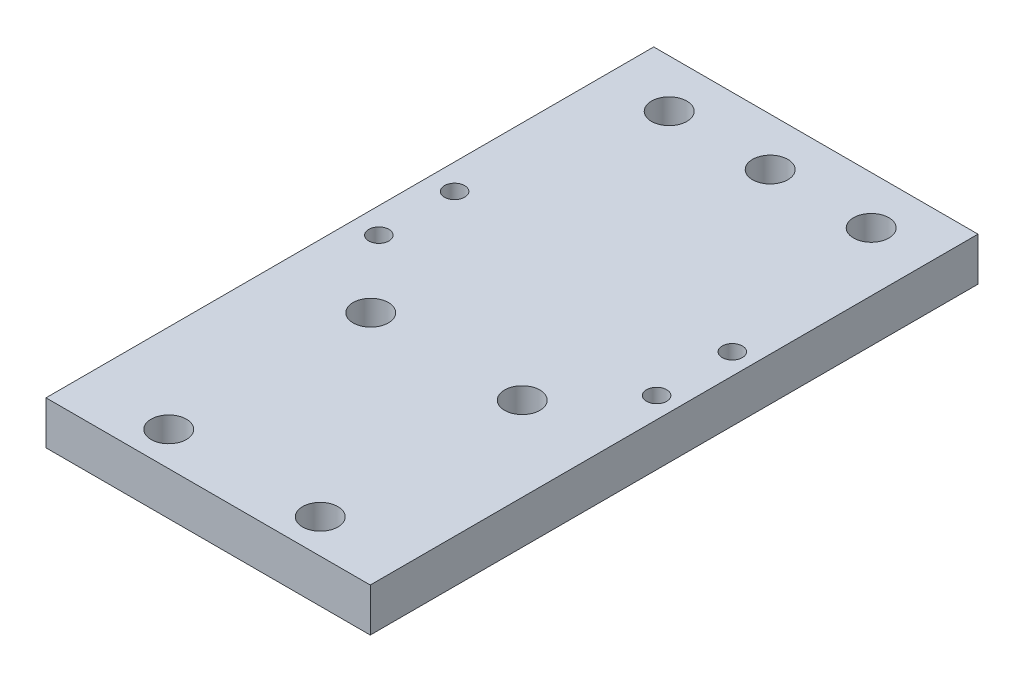
ISO-10303-21;
HEADER;
FILE_DESCRIPTION(('STEP AP214'),'2;1');
FILE_NAME('part.step','',(''),(''),'','','');
FILE_SCHEMA(('AUTOMOTIVE_DESIGN { 1 0 10303 214 1 1 1 1 }'));
ENDSEC;
DATA;
#1=APPLICATION_CONTEXT('core data for automotive mechanical design processes');
#2=APPLICATION_PROTOCOL_DEFINITION('international standard','automotive_design',2000,#1);
#3=PRODUCT_CONTEXT('',#1,'mechanical');
#4=PRODUCT('Part','Part','',(#3));
#5=PRODUCT_RELATED_PRODUCT_CATEGORY('part','',(#4));
#6=PRODUCT_DEFINITION_FORMATION('','',#4);
#7=PRODUCT_DEFINITION_CONTEXT('part definition',#1,'design');
#8=PRODUCT_DEFINITION('design','',#6,#7);
#9=PRODUCT_DEFINITION_SHAPE('','',#8);
#10=(LENGTH_UNIT() NAMED_UNIT(*) SI_UNIT(.MILLI.,.METRE.));
#11=(NAMED_UNIT(*) PLANE_ANGLE_UNIT() SI_UNIT($,.RADIAN.));
#12=(NAMED_UNIT(*) SI_UNIT($,.STERADIAN.) SOLID_ANGLE_UNIT());
#13=UNCERTAINTY_MEASURE_WITH_UNIT(LENGTH_MEASURE(1.E-05),#10,'distance_accuracy_value','');
#14=(GEOMETRIC_REPRESENTATION_CONTEXT(3) GLOBAL_UNCERTAINTY_ASSIGNED_CONTEXT((#13)) GLOBAL_UNIT_ASSIGNED_CONTEXT((#10,
#11,#12)) REPRESENTATION_CONTEXT('',''));
#15=CARTESIAN_POINT('',(0.,0.,0.));
#16=DIRECTION('',(0.,0.,1.));
#17=DIRECTION('',(1.,0.,0.));
#18=AXIS2_PLACEMENT_3D('',#15,#16,#17);
#19=CARTESIAN_POINT('',(16.0528,4.2926,-60.1726));
#20=DIRECTION('',(-1.,0.,0.));
#21=DIRECTION('',(0.,0.,1.));
#22=AXIS2_PLACEMENT_3D('',#19,#20,#21);
#23=PLANE('',#22);
#24=DIRECTION('',(0.,0.,-1.));
#25=VECTOR('',#24,1.);
#26=CARTESIAN_POINT('',(16.0528,0.,-60.1726));
#27=LINE('',#26,#25);
#28=CARTESIAN_POINT('',(16.0528,0.,0.));
#29=VERTEX_POINT('',#28);
#30=CARTESIAN_POINT('',(16.0528,0.,-60.1726));
#31=VERTEX_POINT('',#30);
#32=EDGE_CURVE('E107',#29,#31,#27,.T.);
#33=ORIENTED_EDGE('',*,*,#32,.T.);
#34=DIRECTION('',(0.,-1.,0.));
#35=VECTOR('',#34,1.);
#36=CARTESIAN_POINT('',(16.0528,4.2926,-60.1726));
#37=LINE('',#36,#35);
#38=CARTESIAN_POINT('',(16.0528,4.2926,-60.1726));
#39=VERTEX_POINT('',#38);
#40=EDGE_CURVE('E11',#39,#31,#37,.T.);
#41=ORIENTED_EDGE('',*,*,#40,.F.);
#42=DIRECTION('',(0.,0.,-1.));
#43=VECTOR('',#42,1.);
#44=CARTESIAN_POINT('',(16.0528,4.2926,-60.1726));
#45=LINE('',#44,#43);
#46=CARTESIAN_POINT('',(16.0528,4.2926,0.));
#47=VERTEX_POINT('',#46);
#48=EDGE_CURVE('E91',#47,#39,#45,.T.);
#49=ORIENTED_EDGE('',*,*,#48,.F.);
#50=DIRECTION('',(0.,-1.,0.));
#51=VECTOR('',#50,1.);
#52=CARTESIAN_POINT('',(16.0528,4.2926,0.));
#53=LINE('',#52,#51);
#54=EDGE_CURVE('E103',#47,#29,#53,.T.);
#55=ORIENTED_EDGE('',*,*,#54,.T.);
#56=EDGE_LOOP('',(#33,#41,#49,#55));
#57=FACE_BOUND('',#56,.T.);
#58=ADVANCED_FACE('F39',(#57),#23,.F.);
#59=CARTESIAN_POINT('',(-16.0528,4.2926,-60.1726));
#60=DIRECTION('',(0.,0.,1.));
#61=DIRECTION('',(1.,0.,0.));
#62=AXIS2_PLACEMENT_3D('',#59,#60,#61);
#63=PLANE('',#62);
#64=DIRECTION('',(-1.,0.,0.));
#65=VECTOR('',#64,1.);
#66=CARTESIAN_POINT('',(-16.0528,0.,-60.1726));
#67=LINE('',#66,#65);
#68=CARTESIAN_POINT('',(-16.0528,0.,-60.1726));
#69=VERTEX_POINT('',#68);
#70=EDGE_CURVE('E96',#31,#69,#67,.T.);
#71=ORIENTED_EDGE('',*,*,#70,.T.);
#72=DIRECTION('',(0.,-1.,0.));
#73=VECTOR('',#72,1.);
#74=CARTESIAN_POINT('',(-16.0528,4.2926,-60.1726));
#75=LINE('',#74,#73);
#76=CARTESIAN_POINT('',(-16.0528,4.2926,-60.1726));
#77=VERTEX_POINT('',#76);
#78=EDGE_CURVE('E48',#77,#69,#75,.T.);
#79=ORIENTED_EDGE('',*,*,#78,.F.);
#80=DIRECTION('',(-1.,0.,0.));
#81=VECTOR('',#80,1.);
#82=CARTESIAN_POINT('',(-16.0528,4.2926,-60.1726));
#83=LINE('',#82,#81);
#84=EDGE_CURVE('E86',#39,#77,#83,.T.);
#85=ORIENTED_EDGE('',*,*,#84,.F.);
#86=ORIENTED_EDGE('',*,*,#40,.T.);
#87=EDGE_LOOP('',(#71,#79,#85,#86));
#88=FACE_BOUND('',#87,.T.);
#89=ADVANCED_FACE('F95',(#88),#63,.F.);
#90=CARTESIAN_POINT('',(-16.0528,4.2926,-60.1726));
#91=DIRECTION('',(1.,0.,0.));
#92=DIRECTION('',(0.,0.,-1.));
#93=AXIS2_PLACEMENT_3D('',#90,#91,#92);
#94=PLANE('',#93);
#95=DIRECTION('',(0.,0.,1.));
#96=VECTOR('',#95,1.);
#97=CARTESIAN_POINT('',(-16.0528,0.,-60.1726));
#98=LINE('',#97,#96);
#99=CARTESIAN_POINT('',(-16.0528,0.,0.));
#100=VERTEX_POINT('',#99);
#101=EDGE_CURVE('E73',#69,#100,#98,.T.);
#102=ORIENTED_EDGE('',*,*,#101,.T.);
#103=DIRECTION('',(0.,-1.,0.));
#104=VECTOR('',#103,1.);
#105=CARTESIAN_POINT('',(-16.0528,4.2926,0.));
#106=LINE('',#105,#104);
#107=CARTESIAN_POINT('',(-16.0528,4.2926,0.));
#108=VERTEX_POINT('',#107);
#109=EDGE_CURVE('E98',#108,#100,#106,.T.);
#110=ORIENTED_EDGE('',*,*,#109,.F.);
#111=DIRECTION('',(0.,0.,1.));
#112=VECTOR('',#111,1.);
#113=CARTESIAN_POINT('',(-16.0528,4.2926,-60.1726));
#114=LINE('',#113,#112);
#115=EDGE_CURVE('E89',#77,#108,#114,.T.);
#116=ORIENTED_EDGE('',*,*,#115,.F.);
#117=ORIENTED_EDGE('',*,*,#78,.T.);
#118=EDGE_LOOP('',(#102,#110,#116,#117));
#119=FACE_BOUND('',#118,.T.);
#120=ADVANCED_FACE('F99',(#119),#94,.F.);
#121=CARTESIAN_POINT('',(-16.0528,4.2926,0.));
#122=DIRECTION('',(0.,0.,-1.));
#123=DIRECTION('',(-1.,0.,0.));
#124=AXIS2_PLACEMENT_3D('',#121,#122,#123);
#125=PLANE('',#124);
#126=DIRECTION('',(1.,0.,0.));
#127=VECTOR('',#126,1.);
#128=CARTESIAN_POINT('',(-16.0528,0.,0.));
#129=LINE('',#128,#127);
#130=EDGE_CURVE('E79',#100,#29,#129,.T.);
#131=ORIENTED_EDGE('',*,*,#130,.T.);
#132=ORIENTED_EDGE('',*,*,#54,.F.);
#133=DIRECTION('',(1.,0.,0.));
#134=VECTOR('',#133,1.);
#135=CARTESIAN_POINT('',(-16.0528,4.2926,0.));
#136=LINE('',#135,#134);
#137=EDGE_CURVE('E56',#108,#47,#136,.T.);
#138=ORIENTED_EDGE('',*,*,#137,.F.);
#139=ORIENTED_EDGE('',*,*,#109,.T.);
#140=EDGE_LOOP('',(#131,#132,#138,#139));
#141=FACE_BOUND('',#140,.T.);
#142=ADVANCED_FACE('F121',(#141),#125,.F.);
#143=CARTESIAN_POINT('',(0.,4.2926,0.));
#144=DIRECTION('',(0.,1.,0.));
#145=DIRECTION('',(0.,0.,1.));
#146=AXIS2_PLACEMENT_3D('',#143,#144,#145);
#147=PLANE('',#146);
#148=CARTESIAN_POINT('',(-13.522224542553,4.2926,-30.4226));
#149=DIRECTION('',(0.,1.,0.));
#150=DIRECTION('',(0.,0.,1.));
#151=AXIS2_PLACEMENT_3D('',#148,#149,#150);
#152=CIRCLE('',#151,1.);
#153=CARTESIAN_POINT('',(-13.522224542553,4.2926,-29.4226));
#154=VERTEX_POINT('',#153);
#155=EDGE_CURVE('E136',#154,#154,#152,.T.);
#156=ORIENTED_EDGE('',*,*,#155,.F.);
#157=EDGE_LOOP('',(#156));
#158=FACE_BOUND('',#157,.T.);
#159=CARTESIAN_POINT('',(-13.522224542553,4.2926,-37.9226));
#160=DIRECTION('',(0.,1.,0.));
#161=DIRECTION('',(0.,0.,1.));
#162=AXIS2_PLACEMENT_3D('',#159,#160,#161);
#163=CIRCLE('',#162,1.);
#164=CARTESIAN_POINT('',(-13.522224542553,4.2926,-36.9226));
#165=VERTEX_POINT('',#164);
#166=EDGE_CURVE('E144',#165,#165,#163,.T.);
#167=ORIENTED_EDGE('',*,*,#166,.F.);
#168=EDGE_LOOP('',(#167));
#169=FACE_BOUND('',#168,.T.);
#170=CARTESIAN_POINT('',(0.22777545744697,4.2926,-55.4226));
#171=DIRECTION('',(0.,1.,0.));
#172=DIRECTION('',(0.,0.,1.));
#173=AXIS2_PLACEMENT_3D('',#170,#171,#172);
#174=CIRCLE('',#173,1.75);
#175=CARTESIAN_POINT('',(0.22777545744697,4.2926,-53.6726));
#176=VERTEX_POINT('',#175);
#177=EDGE_CURVE('E178',#176,#176,#174,.T.);
#178=ORIENTED_EDGE('',*,*,#177,.F.);
#179=EDGE_LOOP('',(#178));
#180=FACE_BOUND('',#179,.T.);
#181=CARTESIAN_POINT('',(10.227775457447,4.2926,-55.4226));
#182=DIRECTION('',(0.,1.,0.));
#183=DIRECTION('',(0.,0.,1.));
#184=AXIS2_PLACEMENT_3D('',#181,#182,#183);
#185=CIRCLE('',#184,1.75);
#186=CARTESIAN_POINT('',(10.227775457447,4.2926,-53.6726));
#187=VERTEX_POINT('',#186);
#188=EDGE_CURVE('E170',#187,#187,#185,.T.);
#189=ORIENTED_EDGE('',*,*,#188,.F.);
#190=EDGE_LOOP('',(#189));
#191=FACE_BOUND('',#190,.T.);
#192=CARTESIAN_POINT('',(-7.27222454255303,4.2926,-3.37260000000001));
#193=DIRECTION('',(0.,1.,0.));
#194=DIRECTION('',(0.,0.,1.));
#195=AXIS2_PLACEMENT_3D('',#192,#193,#194);
#196=CIRCLE('',#195,1.75);
#197=CARTESIAN_POINT('',(-7.27222454255303,4.2926,-1.62260000000001));
#198=VERTEX_POINT('',#197);
#199=EDGE_CURVE('E162',#198,#198,#196,.T.);
#200=ORIENTED_EDGE('',*,*,#199,.F.);
#201=EDGE_LOOP('',(#200));
#202=FACE_BOUND('',#201,.T.);
#203=CARTESIAN_POINT('',(-7.27222454255303,4.2926,-23.3726));
#204=DIRECTION('',(0.,1.,0.));
#205=DIRECTION('',(0.,0.,1.));
#206=AXIS2_PLACEMENT_3D('',#203,#204,#205);
#207=CIRCLE('',#206,1.75);
#208=CARTESIAN_POINT('',(-7.27222454255303,4.2926,-21.6226));
#209=VERTEX_POINT('',#208);
#210=EDGE_CURVE('E153',#209,#209,#207,.T.);
#211=ORIENTED_EDGE('',*,*,#210,.F.);
#212=EDGE_LOOP('',(#211));
#213=FACE_BOUND('',#212,.T.);
#214=CARTESIAN_POINT('',(7.72777545744697,4.2926,-23.3726));
#215=DIRECTION('',(0.,1.,0.));
#216=DIRECTION('',(0.,0.,1.));
#217=AXIS2_PLACEMENT_3D('',#214,#215,#216);
#218=CIRCLE('',#217,1.75);
#219=CARTESIAN_POINT('',(7.72777545744697,4.2926,-21.6226));
#220=VERTEX_POINT('',#219);
#221=EDGE_CURVE('E208',#220,#220,#218,.T.);
#222=ORIENTED_EDGE('',*,*,#221,.F.);
#223=EDGE_LOOP('',(#222));
#224=FACE_BOUND('',#223,.T.);
#225=CARTESIAN_POINT('',(7.72777545744697,4.2926,-3.37260000000001));
#226=DIRECTION('',(0.,1.,0.));
#227=DIRECTION('',(0.,0.,1.));
#228=AXIS2_PLACEMENT_3D('',#225,#226,#227);
#229=CIRCLE('',#228,1.75);
#230=CARTESIAN_POINT('',(7.72777545744697,4.2926,-1.62260000000001));
#231=VERTEX_POINT('',#230);
#232=EDGE_CURVE('E200',#231,#231,#229,.T.);
#233=ORIENTED_EDGE('',*,*,#232,.F.);
#234=EDGE_LOOP('',(#233));
#235=FACE_BOUND('',#234,.T.);
#236=CARTESIAN_POINT('',(13.977775457447,4.2926,-30.4226));
#237=DIRECTION('',(0.,1.,0.));
#238=DIRECTION('',(0.,0.,1.));
#239=AXIS2_PLACEMENT_3D('',#236,#237,#238);
#240=CIRCLE('',#239,1.);
#241=CARTESIAN_POINT('',(13.977775457447,4.2926,-29.4226));
#242=VERTEX_POINT('',#241);
#243=EDGE_CURVE('E192',#242,#242,#240,.T.);
#244=ORIENTED_EDGE('',*,*,#243,.F.);
#245=EDGE_LOOP('',(#244));
#246=FACE_BOUND('',#245,.T.);
#247=CARTESIAN_POINT('',(13.977775457447,4.2926,-37.9226));
#248=DIRECTION('',(0.,1.,0.));
#249=DIRECTION('',(0.,0.,1.));
#250=AXIS2_PLACEMENT_3D('',#247,#248,#249);
#251=CIRCLE('',#250,1.);
#252=CARTESIAN_POINT('',(13.977775457447,4.2926,-36.9226));
#253=VERTEX_POINT('',#252);
#254=EDGE_CURVE('E152',#253,#253,#251,.T.);
#255=ORIENTED_EDGE('',*,*,#254,.F.);
#256=EDGE_LOOP('',(#255));
#257=FACE_BOUND('',#256,.T.);
#258=CARTESIAN_POINT('',(-9.77222454255303,4.2926,-55.4226));
#259=DIRECTION('',(0.,1.,0.));
#260=DIRECTION('',(0.,0.,1.));
#261=AXIS2_PLACEMENT_3D('',#258,#259,#260);
#262=CIRCLE('',#261,1.75);
#263=CARTESIAN_POINT('',(-9.77222454255303,4.2926,-53.6726));
#264=VERTEX_POINT('',#263);
#265=EDGE_CURVE('E128',#264,#264,#262,.T.);
#266=ORIENTED_EDGE('',*,*,#265,.F.);
#267=EDGE_LOOP('',(#266));
#268=FACE_BOUND('',#267,.T.);
#269=ORIENTED_EDGE('',*,*,#48,.T.);
#270=ORIENTED_EDGE('',*,*,#84,.T.);
#271=ORIENTED_EDGE('',*,*,#115,.T.);
#272=ORIENTED_EDGE('',*,*,#137,.T.);
#273=EDGE_LOOP('',(#269,#270,#271,#272));
#274=FACE_BOUND('',#273,.T.);
#275=ADVANCED_FACE('F87',(#158,#169,#180,#191,#202,#213,#224,#235,#246,#257,#268,#274),#147,.T.);
#276=CARTESIAN_POINT('',(0.,0.,0.));
#277=DIRECTION('',(0.,1.,0.));
#278=DIRECTION('',(0.,0.,1.));
#279=AXIS2_PLACEMENT_3D('',#276,#277,#278);
#280=PLANE('',#279);
#281=CARTESIAN_POINT('',(-13.522224542553,0.,-30.4226));
#282=DIRECTION('',(0.,1.,0.));
#283=DIRECTION('',(0.,0.,1.));
#284=AXIS2_PLACEMENT_3D('',#281,#282,#283);
#285=CIRCLE('',#284,1.);
#286=CARTESIAN_POINT('',(-13.522224542553,0.,-29.4226));
#287=VERTEX_POINT('',#286);
#288=EDGE_CURVE('E140',#287,#287,#285,.T.);
#289=ORIENTED_EDGE('',*,*,#288,.T.);
#290=EDGE_LOOP('',(#289));
#291=FACE_BOUND('',#290,.T.);
#292=CARTESIAN_POINT('',(-13.522224542553,0.,-37.9226));
#293=DIRECTION('',(0.,1.,0.));
#294=DIRECTION('',(0.,0.,1.));
#295=AXIS2_PLACEMENT_3D('',#292,#293,#294);
#296=CIRCLE('',#295,1.);
#297=CARTESIAN_POINT('',(-13.522224542553,0.,-36.9226));
#298=VERTEX_POINT('',#297);
#299=EDGE_CURVE('E148',#298,#298,#296,.T.);
#300=ORIENTED_EDGE('',*,*,#299,.T.);
#301=EDGE_LOOP('',(#300));
#302=FACE_BOUND('',#301,.T.);
#303=CARTESIAN_POINT('',(0.22777545744697,0.,-55.4226));
#304=DIRECTION('',(0.,1.,0.));
#305=DIRECTION('',(0.,0.,1.));
#306=AXIS2_PLACEMENT_3D('',#303,#304,#305);
#307=CIRCLE('',#306,1.75);
#308=CARTESIAN_POINT('',(0.22777545744697,0.,-53.6726));
#309=VERTEX_POINT('',#308);
#310=EDGE_CURVE('E132',#309,#309,#307,.T.);
#311=ORIENTED_EDGE('',*,*,#310,.T.);
#312=EDGE_LOOP('',(#311));
#313=FACE_BOUND('',#312,.T.);
#314=CARTESIAN_POINT('',(10.227775457447,0.,-55.4226));
#315=DIRECTION('',(0.,1.,0.));
#316=DIRECTION('',(0.,0.,1.));
#317=AXIS2_PLACEMENT_3D('',#314,#315,#316);
#318=CIRCLE('',#317,1.75);
#319=CARTESIAN_POINT('',(10.227775457447,0.,-53.6726));
#320=VERTEX_POINT('',#319);
#321=EDGE_CURVE('E174',#320,#320,#318,.T.);
#322=ORIENTED_EDGE('',*,*,#321,.T.);
#323=EDGE_LOOP('',(#322));
#324=FACE_BOUND('',#323,.T.);
#325=CARTESIAN_POINT('',(-7.27222454255303,0.,-3.37260000000001));
#326=DIRECTION('',(0.,1.,0.));
#327=DIRECTION('',(0.,0.,1.));
#328=AXIS2_PLACEMENT_3D('',#325,#326,#327);
#329=CIRCLE('',#328,1.75);
#330=CARTESIAN_POINT('',(-7.27222454255303,0.,-1.62260000000001));
#331=VERTEX_POINT('',#330);
#332=EDGE_CURVE('E166',#331,#331,#329,.T.);
#333=ORIENTED_EDGE('',*,*,#332,.T.);
#334=EDGE_LOOP('',(#333));
#335=FACE_BOUND('',#334,.T.);
#336=CARTESIAN_POINT('',(-7.27222454255303,0.,-23.3726));
#337=DIRECTION('',(0.,1.,0.));
#338=DIRECTION('',(0.,0.,1.));
#339=AXIS2_PLACEMENT_3D('',#336,#337,#338);
#340=CIRCLE('',#339,1.75);
#341=CARTESIAN_POINT('',(-7.27222454255303,0.,-21.6226));
#342=VERTEX_POINT('',#341);
#343=EDGE_CURVE('E157',#342,#342,#340,.T.);
#344=ORIENTED_EDGE('',*,*,#343,.T.);
#345=EDGE_LOOP('',(#344));
#346=FACE_BOUND('',#345,.T.);
#347=CARTESIAN_POINT('',(7.72777545744697,0.,-23.3726));
#348=DIRECTION('',(0.,1.,0.));
#349=DIRECTION('',(0.,0.,1.));
#350=AXIS2_PLACEMENT_3D('',#347,#348,#349);
#351=CIRCLE('',#350,1.75);
#352=CARTESIAN_POINT('',(7.72777545744697,0.,-21.6226));
#353=VERTEX_POINT('',#352);
#354=EDGE_CURVE('E158',#353,#353,#351,.T.);
#355=ORIENTED_EDGE('',*,*,#354,.T.);
#356=EDGE_LOOP('',(#355));
#357=FACE_BOUND('',#356,.T.);
#358=CARTESIAN_POINT('',(7.72777545744697,0.,-3.37260000000001));
#359=DIRECTION('',(0.,1.,0.));
#360=DIRECTION('',(0.,0.,1.));
#361=AXIS2_PLACEMENT_3D('',#358,#359,#360);
#362=CIRCLE('',#361,1.75);
#363=CARTESIAN_POINT('',(7.72777545744697,0.,-1.62260000000001));
#364=VERTEX_POINT('',#363);
#365=EDGE_CURVE('E204',#364,#364,#362,.T.);
#366=ORIENTED_EDGE('',*,*,#365,.T.);
#367=EDGE_LOOP('',(#366));
#368=FACE_BOUND('',#367,.T.);
#369=CARTESIAN_POINT('',(13.977775457447,0.,-30.4226));
#370=DIRECTION('',(0.,1.,0.));
#371=DIRECTION('',(0.,0.,1.));
#372=AXIS2_PLACEMENT_3D('',#369,#370,#371);
#373=CIRCLE('',#372,1.);
#374=CARTESIAN_POINT('',(13.977775457447,0.,-29.4226));
#375=VERTEX_POINT('',#374);
#376=EDGE_CURVE('E196',#375,#375,#373,.T.);
#377=ORIENTED_EDGE('',*,*,#376,.T.);
#378=EDGE_LOOP('',(#377));
#379=FACE_BOUND('',#378,.T.);
#380=CARTESIAN_POINT('',(13.977775457447,0.,-37.9226));
#381=DIRECTION('',(0.,1.,0.));
#382=DIRECTION('',(0.,0.,1.));
#383=AXIS2_PLACEMENT_3D('',#380,#381,#382);
#384=CIRCLE('',#383,1.);
#385=CARTESIAN_POINT('',(13.977775457447,0.,-36.9226));
#386=VERTEX_POINT('',#385);
#387=EDGE_CURVE('E188',#386,#386,#384,.T.);
#388=ORIENTED_EDGE('',*,*,#387,.T.);
#389=EDGE_LOOP('',(#388));
#390=FACE_BOUND('',#389,.T.);
#391=CARTESIAN_POINT('',(-9.77222454255303,0.,-55.4226));
#392=DIRECTION('',(0.,1.,0.));
#393=DIRECTION('',(0.,0.,1.));
#394=AXIS2_PLACEMENT_3D('',#391,#392,#393);
#395=CIRCLE('',#394,1.75);
#396=CARTESIAN_POINT('',(-9.77222454255303,0.,-53.6726));
#397=VERTEX_POINT('',#396);
#398=EDGE_CURVE('E111',#397,#397,#395,.T.);
#399=ORIENTED_EDGE('',*,*,#398,.T.);
#400=EDGE_LOOP('',(#399));
#401=FACE_BOUND('',#400,.T.);
#402=ORIENTED_EDGE('',*,*,#32,.F.);
#403=ORIENTED_EDGE('',*,*,#130,.F.);
#404=ORIENTED_EDGE('',*,*,#101,.F.);
#405=ORIENTED_EDGE('',*,*,#70,.F.);
#406=EDGE_LOOP('',(#402,#403,#404,#405));
#407=FACE_BOUND('',#406,.T.);
#408=ADVANCED_FACE('F124',(#291,#302,#313,#324,#335,#346,#357,#368,#379,#390,#401,#407),#280,.F.);
#409=CARTESIAN_POINT('',(-9.77222454255303,0.,-55.4226));
#410=DIRECTION('',(0.,1.,0.));
#411=DIRECTION('',(0.,0.,1.));
#412=AXIS2_PLACEMENT_3D('',#409,#410,#411);
#413=CYLINDRICAL_SURFACE('',#412,1.75);
#414=ORIENTED_EDGE('',*,*,#398,.F.);
#415=EDGE_LOOP('',(#414));
#416=FACE_BOUND('',#415,.T.);
#417=ORIENTED_EDGE('',*,*,#265,.T.);
#418=EDGE_LOOP('',(#417));
#419=FACE_BOUND('',#418,.T.);
#420=ADVANCED_FACE('F238',(#416,#419),#413,.F.);
#421=CARTESIAN_POINT('',(13.977775457447,0.,-37.9226));
#422=DIRECTION('',(0.,1.,0.));
#423=DIRECTION('',(0.,0.,1.));
#424=AXIS2_PLACEMENT_3D('',#421,#422,#423);
#425=CYLINDRICAL_SURFACE('',#424,1.);
#426=ORIENTED_EDGE('',*,*,#387,.F.);
#427=EDGE_LOOP('',(#426));
#428=FACE_BOUND('',#427,.T.);
#429=ORIENTED_EDGE('',*,*,#254,.T.);
#430=EDGE_LOOP('',(#429));
#431=FACE_BOUND('',#430,.T.);
#432=ADVANCED_FACE('F240',(#428,#431),#425,.F.);
#433=CARTESIAN_POINT('',(13.977775457447,0.,-30.4226));
#434=DIRECTION('',(0.,1.,0.));
#435=DIRECTION('',(0.,0.,1.));
#436=AXIS2_PLACEMENT_3D('',#433,#434,#435);
#437=CYLINDRICAL_SURFACE('',#436,1.);
#438=ORIENTED_EDGE('',*,*,#376,.F.);
#439=EDGE_LOOP('',(#438));
#440=FACE_BOUND('',#439,.T.);
#441=ORIENTED_EDGE('',*,*,#243,.T.);
#442=EDGE_LOOP('',(#441));
#443=FACE_BOUND('',#442,.T.);
#444=ADVANCED_FACE('F247',(#440,#443),#437,.F.);
#445=CARTESIAN_POINT('',(7.72777545744697,0.,-3.37260000000001));
#446=DIRECTION('',(0.,1.,0.));
#447=DIRECTION('',(0.,0.,1.));
#448=AXIS2_PLACEMENT_3D('',#445,#446,#447);
#449=CYLINDRICAL_SURFACE('',#448,1.75);
#450=ORIENTED_EDGE('',*,*,#365,.F.);
#451=EDGE_LOOP('',(#450));
#452=FACE_BOUND('',#451,.T.);
#453=ORIENTED_EDGE('',*,*,#232,.T.);
#454=EDGE_LOOP('',(#453));
#455=FACE_BOUND('',#454,.T.);
#456=ADVANCED_FACE('F222',(#452,#455),#449,.F.);
#457=CARTESIAN_POINT('',(7.72777545744697,0.,-23.3726));
#458=DIRECTION('',(0.,1.,0.));
#459=DIRECTION('',(0.,0.,1.));
#460=AXIS2_PLACEMENT_3D('',#457,#458,#459);
#461=CYLINDRICAL_SURFACE('',#460,1.75);
#462=ORIENTED_EDGE('',*,*,#354,.F.);
#463=EDGE_LOOP('',(#462));
#464=FACE_BOUND('',#463,.T.);
#465=ORIENTED_EDGE('',*,*,#221,.T.);
#466=EDGE_LOOP('',(#465));
#467=FACE_BOUND('',#466,.T.);
#468=ADVANCED_FACE('F218',(#464,#467),#461,.F.);
#469=CARTESIAN_POINT('',(-7.27222454255303,0.,-23.3726));
#470=DIRECTION('',(0.,1.,0.));
#471=DIRECTION('',(0.,0.,1.));
#472=AXIS2_PLACEMENT_3D('',#469,#470,#471);
#473=CYLINDRICAL_SURFACE('',#472,1.75);
#474=ORIENTED_EDGE('',*,*,#343,.F.);
#475=EDGE_LOOP('',(#474));
#476=FACE_BOUND('',#475,.T.);
#477=ORIENTED_EDGE('',*,*,#210,.T.);
#478=EDGE_LOOP('',(#477));
#479=FACE_BOUND('',#478,.T.);
#480=ADVANCED_FACE('F221',(#476,#479),#473,.F.);
#481=CARTESIAN_POINT('',(-7.27222454255303,0.,-3.37260000000001));
#482=DIRECTION('',(0.,1.,0.));
#483=DIRECTION('',(0.,0.,1.));
#484=AXIS2_PLACEMENT_3D('',#481,#482,#483);
#485=CYLINDRICAL_SURFACE('',#484,1.75);
#486=ORIENTED_EDGE('',*,*,#332,.F.);
#487=EDGE_LOOP('',(#486));
#488=FACE_BOUND('',#487,.T.);
#489=ORIENTED_EDGE('',*,*,#199,.T.);
#490=EDGE_LOOP('',(#489));
#491=FACE_BOUND('',#490,.T.);
#492=ADVANCED_FACE('F319',(#488,#491),#485,.F.);
#493=CARTESIAN_POINT('',(10.227775457447,0.,-55.4226));
#494=DIRECTION('',(0.,1.,0.));
#495=DIRECTION('',(0.,0.,1.));
#496=AXIS2_PLACEMENT_3D('',#493,#494,#495);
#497=CYLINDRICAL_SURFACE('',#496,1.75);
#498=ORIENTED_EDGE('',*,*,#321,.F.);
#499=EDGE_LOOP('',(#498));
#500=FACE_BOUND('',#499,.T.);
#501=ORIENTED_EDGE('',*,*,#188,.T.);
#502=EDGE_LOOP('',(#501));
#503=FACE_BOUND('',#502,.T.);
#504=ADVANCED_FACE('F329',(#500,#503),#497,.F.);
#505=CARTESIAN_POINT('',(0.22777545744697,0.,-55.4226));
#506=DIRECTION('',(0.,1.,0.));
#507=DIRECTION('',(0.,0.,1.));
#508=AXIS2_PLACEMENT_3D('',#505,#506,#507);
#509=CYLINDRICAL_SURFACE('',#508,1.75);
#510=ORIENTED_EDGE('',*,*,#310,.F.);
#511=EDGE_LOOP('',(#510));
#512=FACE_BOUND('',#511,.T.);
#513=ORIENTED_EDGE('',*,*,#177,.T.);
#514=EDGE_LOOP('',(#513));
#515=FACE_BOUND('',#514,.T.);
#516=ADVANCED_FACE('F339',(#512,#515),#509,.F.);
#517=CARTESIAN_POINT('',(-13.522224542553,0.,-37.9226));
#518=DIRECTION('',(0.,1.,0.));
#519=DIRECTION('',(0.,0.,1.));
#520=AXIS2_PLACEMENT_3D('',#517,#518,#519);
#521=CYLINDRICAL_SURFACE('',#520,1.);
#522=ORIENTED_EDGE('',*,*,#299,.F.);
#523=EDGE_LOOP('',(#522));
#524=FACE_BOUND('',#523,.T.);
#525=ORIENTED_EDGE('',*,*,#166,.T.);
#526=EDGE_LOOP('',(#525));
#527=FACE_BOUND('',#526,.T.);
#528=ADVANCED_FACE('F349',(#524,#527),#521,.F.);
#529=CARTESIAN_POINT('',(-13.522224542553,0.,-30.4226));
#530=DIRECTION('',(0.,1.,0.));
#531=DIRECTION('',(0.,0.,1.));
#532=AXIS2_PLACEMENT_3D('',#529,#530,#531);
#533=CYLINDRICAL_SURFACE('',#532,1.);
#534=ORIENTED_EDGE('',*,*,#288,.F.);
#535=EDGE_LOOP('',(#534));
#536=FACE_BOUND('',#535,.T.);
#537=ORIENTED_EDGE('',*,*,#155,.T.);
#538=EDGE_LOOP('',(#537));
#539=FACE_BOUND('',#538,.T.);
#540=ADVANCED_FACE('F359',(#536,#539),#533,.F.);
#541=CLOSED_SHELL('',(#58,#89,#120,#142,#275,#408,#420,#432,#444,#456,#468,#480,#492,#504,#516,
#528,#540));
#542=MANIFOLD_SOLID_BREP('B2',#541);
#543=ADVANCED_BREP_SHAPE_REPRESENTATION('',(#18,#542),#14);
#544=SHAPE_DEFINITION_REPRESENTATION(#9,#543);
ENDSEC;
END-ISO-10303-21;
